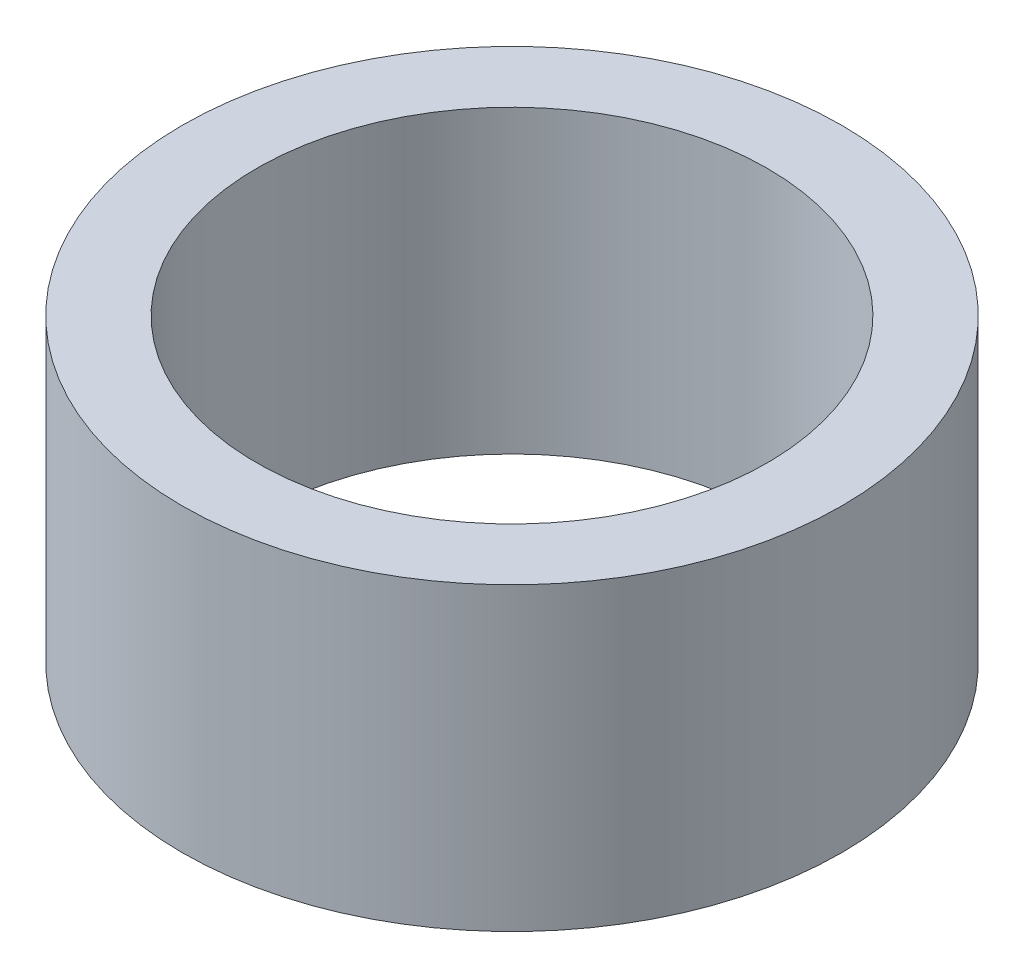
ISO-10303-21;
HEADER;
FILE_DESCRIPTION(('STEP AP214'),'2;1');
FILE_NAME('part.step','',(''),(''),'','','');
FILE_SCHEMA(('AUTOMOTIVE_DESIGN { 1 0 10303 214 1 1 1 1 }'));
ENDSEC;
DATA;
#1=APPLICATION_CONTEXT('core data for automotive mechanical design processes');
#2=APPLICATION_PROTOCOL_DEFINITION('international standard','automotive_design',2000,#1);
#3=PRODUCT_CONTEXT('',#1,'mechanical');
#4=PRODUCT('Part','Part','',(#3));
#5=PRODUCT_RELATED_PRODUCT_CATEGORY('part','',(#4));
#6=PRODUCT_DEFINITION_FORMATION('','',#4);
#7=PRODUCT_DEFINITION_CONTEXT('part definition',#1,'design');
#8=PRODUCT_DEFINITION('design','',#6,#7);
#9=PRODUCT_DEFINITION_SHAPE('','',#8);
#10=(LENGTH_UNIT() NAMED_UNIT(*) SI_UNIT(.MILLI.,.METRE.));
#11=(NAMED_UNIT(*) PLANE_ANGLE_UNIT() SI_UNIT($,.RADIAN.));
#12=(NAMED_UNIT(*) SI_UNIT($,.STERADIAN.) SOLID_ANGLE_UNIT());
#13=UNCERTAINTY_MEASURE_WITH_UNIT(LENGTH_MEASURE(1.E-05),#10,'distance_accuracy_value','');
#14=(GEOMETRIC_REPRESENTATION_CONTEXT(3) GLOBAL_UNCERTAINTY_ASSIGNED_CONTEXT((#13)) GLOBAL_UNIT_ASSIGNED_CONTEXT((#10,
#11,#12)) REPRESENTATION_CONTEXT('',''));
#15=CARTESIAN_POINT('',(0.,0.,0.));
#16=DIRECTION('',(0.,0.,1.));
#17=DIRECTION('',(1.,0.,0.));
#18=AXIS2_PLACEMENT_3D('',#15,#16,#17);
#19=CARTESIAN_POINT('',(0.,13.6638949893559,0.));
#20=DIRECTION('',(0.,-1.,0.));
#21=DIRECTION('',(0.,0.,-1.));
#22=AXIS2_PLACEMENT_3D('',#19,#20,#21);
#23=CYLINDRICAL_SURFACE('',#22,15.);
#24=CARTESIAN_POINT('',(0.,13.6638949893559,0.));
#25=DIRECTION('',(0.,1.,0.));
#26=DIRECTION('',(0.,0.,1.));
#27=AXIS2_PLACEMENT_3D('',#24,#25,#26);
#28=CIRCLE('',#27,15.);
#29=CARTESIAN_POINT('',(0.,13.6638949893559,-15.));
#30=VERTEX_POINT('',#29);
#31=EDGE_CURVE('E10',#30,#30,#28,.T.);
#32=CARTESIAN_POINT('',(0.,0.,0.));
#33=DIRECTION('',(0.,1.,0.));
#34=DIRECTION('',(0.,0.,1.));
#35=AXIS2_PLACEMENT_3D('',#32,#33,#34);
#36=CIRCLE('',#35,15.);
#37=CARTESIAN_POINT('',(0.,0.,-15.));
#38=VERTEX_POINT('',#37);
#39=EDGE_CURVE('E37',#38,#38,#36,.T.);
#40=CARTESIAN_POINT('',(0.,13.6638949893559,-15.));
#41=CARTESIAN_POINT('',(0.,13.5215627498835,-15.));
#42=CARTESIAN_POINT('',(0.,13.379230510411,-15.));
#43=CARTESIAN_POINT('',(0.,13.0945660314661,-15.));
#44=CARTESIAN_POINT('',(0.,12.9522337919936,-15.));
#45=CARTESIAN_POINT('',(0.,12.6675693130487,-15.));
#46=CARTESIAN_POINT('',(0.,12.5252370735763,-15.));
#47=CARTESIAN_POINT('',(0.,12.2405725946314,-15.));
#48=CARTESIAN_POINT('',(0.,12.0982403551589,-15.));
#49=CARTESIAN_POINT('',(0.,11.813575876214,-15.));
#50=CARTESIAN_POINT('',(0.,11.6712436367415,-15.));
#51=CARTESIAN_POINT('',(0.,11.3865791577966,-15.));
#52=CARTESIAN_POINT('',(0.,11.2442469183242,-15.));
#53=CARTESIAN_POINT('',(0.,10.9595824393792,-15.));
#54=CARTESIAN_POINT('',(0.,10.8172501999068,-15.));
#55=CARTESIAN_POINT('',(0.,10.5325857209619,-15.));
#56=CARTESIAN_POINT('',(0.,10.3902534814894,-15.));
#57=CARTESIAN_POINT('',(0.,10.1055890025445,-15.));
#58=CARTESIAN_POINT('',(0.,9.96325676307203,-15.));
#59=CARTESIAN_POINT('',(0.,9.67859228412712,-15.));
#60=CARTESIAN_POINT('',(0.,9.53626004465466,-15.));
#61=CARTESIAN_POINT('',(0.,9.25159556570974,-15.));
#62=CARTESIAN_POINT('',(0.,9.10926332623729,-15.));
#63=CARTESIAN_POINT('',(0.,8.82459884729237,-15.));
#64=CARTESIAN_POINT('',(0.,8.68226660781992,-15.));
#65=CARTESIAN_POINT('',(0.,8.397602128875,-15.));
#66=CARTESIAN_POINT('',(0.,8.25526988940254,-15.));
#67=CARTESIAN_POINT('',(0.,7.97060541045763,-15.));
#68=CARTESIAN_POINT('',(0.,7.82827317098517,-15.));
#69=CARTESIAN_POINT('',(0.,7.54360869204025,-15.));
#70=CARTESIAN_POINT('',(0.,7.4012764525678,-15.));
#71=CARTESIAN_POINT('',(0.,7.11661197362288,-15.));
#72=CARTESIAN_POINT('',(0.,6.97427973415042,-15.));
#73=CARTESIAN_POINT('',(0.,6.68961525520551,-15.));
#74=CARTESIAN_POINT('',(0.,6.54728301573305,-15.));
#75=CARTESIAN_POINT('',(0.,6.26261853678813,-15.));
#76=CARTESIAN_POINT('',(0.,6.12028629731568,-15.));
#77=CARTESIAN_POINT('',(0.,5.83562181837076,-15.));
#78=CARTESIAN_POINT('',(0.,5.69328957889831,-15.));
#79=CARTESIAN_POINT('',(0.,5.40862509995339,-15.));
#80=CARTESIAN_POINT('',(0.,5.26629286048093,-15.));
#81=CARTESIAN_POINT('',(0.,4.98162838153602,-15.));
#82=CARTESIAN_POINT('',(0.,4.83929614206356,-15.));
#83=CARTESIAN_POINT('',(0.,4.55463166311864,-15.));
#84=CARTESIAN_POINT('',(0.,4.41229942364619,-15.));
#85=CARTESIAN_POINT('',(0.,4.12763494470127,-15.));
#86=CARTESIAN_POINT('',(0.,3.98530270522881,-15.));
#87=CARTESIAN_POINT('',(0.,3.7006382262839,-15.));
#88=CARTESIAN_POINT('',(0.,3.55830598681144,-15.));
#89=CARTESIAN_POINT('',(0.,3.27364150786653,-15.));
#90=CARTESIAN_POINT('',(0.,3.13130926839407,-15.));
#91=CARTESIAN_POINT('',(0.,2.84664478944915,-15.));
#92=CARTESIAN_POINT('',(0.,2.70431254997669,-15.));
#93=CARTESIAN_POINT('',(0.,2.41964807103178,-15.));
#94=CARTESIAN_POINT('',(0.,2.27731583155932,-15.));
#95=CARTESIAN_POINT('',(0.,1.99265135261441,-15.));
#96=CARTESIAN_POINT('',(0.,1.85031911314195,-15.));
#97=CARTESIAN_POINT('',(0.,1.56565463419703,-15.));
#98=CARTESIAN_POINT('',(0.,1.42332239472458,-15.));
#99=CARTESIAN_POINT('',(0.,1.13865791577966,-15.));
#100=CARTESIAN_POINT('',(0.,0.996325676307204,-15.));
#101=CARTESIAN_POINT('',(0.,0.711661197362289,-15.));
#102=CARTESIAN_POINT('',(0.,0.569328957889831,-15.));
#103=CARTESIAN_POINT('',(0.,0.284664478944915,-15.));
#104=CARTESIAN_POINT('',(0.,0.142332239472458,-15.));
#105=CARTESIAN_POINT('',(0.,0.,-15.));
#106=B_SPLINE_CURVE_WITH_KNOTS('',3,(#40,#41,#42,#43,#44,#45,#46,#47,#48,#49,#50,#51,#52,#53,
#54,#55,#56,#57,#58,#59,#60,#61,#62,#63,#64,#65,#66,#67,#68,#69,#70,#71,#72,#73,#74,#75,#76,#77,
#78,#79,#80,#81,#82,#83,#84,#85,#86,#87,#88,#89,#90,#91,#92,#93,#94,#95,#96,#97,#98,#99,#100,
#101,#102,#103,#104,#105),.UNSPECIFIED.,.F.,.F.,(4,2,2,2,2,2,2,2,2,2,2,2,2,2,2,2,2,2,2,2,2,2,2,
2,2,2,2,2,2,2,2,2,4),(0.,0.426996718417371,0.853993436834744,1.28099015525212,1.70798687366949,
2.13498359208686,2.56198031050424,2.98897702892161,3.41597374733898,3.84297046575635,
4.26996718417373,4.6969639025911,5.12396062100847,5.55095733942585,5.97795405784322,
6.40495077626059,6.83194749467796,7.25894421309534,7.68594093151271,8.11293764993008,
8.53993436834746,8.96693108676483,9.3939278051822,9.82092452359957,10.2479212420169,
10.6749179604343,11.1019146788517,11.5289113972691,11.9559081156864,12.3829048341038,
12.8099015525212,13.2368982709386,13.6638949893559),.UNSPECIFIED.);
#107=EDGE_CURVE('BSEAM40',#30,#38,#106,.T.);
#108=ORIENTED_EDGE('',*,*,#31,.F.);
#109=ORIENTED_EDGE('',*,*,#39,.T.);
#110=ORIENTED_EDGE('',*,*,#107,.T.);
#111=ORIENTED_EDGE('',*,*,#107,.F.);
#112=EDGE_LOOP('',(#108,#110,#109,#111));
#113=FACE_BOUND('',#112,.T.);
#114=ADVANCED_FACE('F40',(#113),#23,.T.);
#115=CARTESIAN_POINT('',(0.,13.6638949893559,0.));
#116=DIRECTION('',(0.,1.,0.));
#117=DIRECTION('',(0.,0.,1.));
#118=AXIS2_PLACEMENT_3D('',#115,#116,#117);
#119=PLANE('',#118);
#120=CARTESIAN_POINT('',(0.,13.6638949893559,0.));
#121=DIRECTION('',(0.,1.,0.));
#122=DIRECTION('',(0.,0.,1.));
#123=AXIS2_PLACEMENT_3D('',#120,#121,#122);
#124=CIRCLE('',#123,11.611398963864);
#125=CARTESIAN_POINT('',(0.,13.6638949893559,-11.611398963864));
#126=VERTEX_POINT('',#125);
#127=EDGE_CURVE('E50',#126,#126,#124,.T.);
#128=ORIENTED_EDGE('',*,*,#127,.F.);
#129=EDGE_LOOP('',(#128));
#130=FACE_BOUND('',#129,.T.);
#131=ORIENTED_EDGE('',*,*,#31,.T.);
#132=EDGE_LOOP('',(#131));
#133=FACE_BOUND('',#132,.T.);
#134=ADVANCED_FACE('F59',(#130,#133),#119,.T.);
#135=CARTESIAN_POINT('',(0.,0.,0.));
#136=DIRECTION('',(0.,1.,0.));
#137=DIRECTION('',(0.,0.,1.));
#138=AXIS2_PLACEMENT_3D('',#135,#136,#137);
#139=PLANE('',#138);
#140=CARTESIAN_POINT('',(0.,0.,0.));
#141=DIRECTION('',(0.,1.,0.));
#142=DIRECTION('',(0.,0.,1.));
#143=AXIS2_PLACEMENT_3D('',#140,#141,#142);
#144=CIRCLE('',#143,11.611398963864);
#145=CARTESIAN_POINT('',(0.,0.,-11.611398963864));
#146=VERTEX_POINT('',#145);
#147=EDGE_CURVE('E47',#146,#146,#144,.T.);
#148=ORIENTED_EDGE('',*,*,#147,.T.);
#149=EDGE_LOOP('',(#148));
#150=FACE_BOUND('',#149,.T.);
#151=ORIENTED_EDGE('',*,*,#39,.F.);
#152=EDGE_LOOP('',(#151));
#153=FACE_BOUND('',#152,.T.);
#154=ADVANCED_FACE('F58',(#150,#153),#139,.F.);
#155=CARTESIAN_POINT('',(0.,13.6638949893559,0.));
#156=DIRECTION('',(0.,-1.,0.));
#157=DIRECTION('',(0.,0.,-1.));
#158=AXIS2_PLACEMENT_3D('',#155,#156,#157);
#159=CYLINDRICAL_SURFACE('',#158,11.611398963864);
#160=CARTESIAN_POINT('',(0.,13.6638949893559,-11.611398963864));
#161=CARTESIAN_POINT('',(0.,13.5215627498835,-11.611398963864));
#162=CARTESIAN_POINT('',(0.,13.379230510411,-11.611398963864));
#163=CARTESIAN_POINT('',(0.,13.0945660314661,-11.611398963864));
#164=CARTESIAN_POINT('',(0.,12.9522337919936,-11.611398963864));
#165=CARTESIAN_POINT('',(0.,12.6675693130487,-11.611398963864));
#166=CARTESIAN_POINT('',(0.,12.5252370735763,-11.611398963864));
#167=CARTESIAN_POINT('',(0.,12.2405725946314,-11.611398963864));
#168=CARTESIAN_POINT('',(0.,12.0982403551589,-11.611398963864));
#169=CARTESIAN_POINT('',(0.,11.813575876214,-11.611398963864));
#170=CARTESIAN_POINT('',(0.,11.6712436367415,-11.611398963864));
#171=CARTESIAN_POINT('',(0.,11.3865791577966,-11.611398963864));
#172=CARTESIAN_POINT('',(0.,11.2442469183242,-11.611398963864));
#173=CARTESIAN_POINT('',(0.,10.9595824393792,-11.611398963864));
#174=CARTESIAN_POINT('',(0.,10.8172501999068,-11.611398963864));
#175=CARTESIAN_POINT('',(0.,10.5325857209619,-11.611398963864));
#176=CARTESIAN_POINT('',(0.,10.3902534814894,-11.611398963864));
#177=CARTESIAN_POINT('',(0.,10.1055890025445,-11.611398963864));
#178=CARTESIAN_POINT('',(0.,9.96325676307203,-11.611398963864));
#179=CARTESIAN_POINT('',(0.,9.67859228412712,-11.611398963864));
#180=CARTESIAN_POINT('',(0.,9.53626004465466,-11.611398963864));
#181=CARTESIAN_POINT('',(0.,9.25159556570974,-11.611398963864));
#182=CARTESIAN_POINT('',(0.,9.10926332623729,-11.611398963864));
#183=CARTESIAN_POINT('',(0.,8.82459884729237,-11.611398963864));
#184=CARTESIAN_POINT('',(0.,8.68226660781991,-11.611398963864));
#185=CARTESIAN_POINT('',(0.,8.397602128875,-11.611398963864));
#186=CARTESIAN_POINT('',(0.,8.25526988940254,-11.611398963864));
#187=CARTESIAN_POINT('',(0.,7.97060541045763,-11.611398963864));
#188=CARTESIAN_POINT('',(0.,7.82827317098517,-11.611398963864));
#189=CARTESIAN_POINT('',(0.,7.54360869204025,-11.611398963864));
#190=CARTESIAN_POINT('',(0.,7.4012764525678,-11.611398963864));
#191=CARTESIAN_POINT('',(0.,7.11661197362288,-11.611398963864));
#192=CARTESIAN_POINT('',(0.,6.97427973415042,-11.611398963864));
#193=CARTESIAN_POINT('',(0.,6.68961525520551,-11.611398963864));
#194=CARTESIAN_POINT('',(0.,6.54728301573305,-11.611398963864));
#195=CARTESIAN_POINT('',(0.,6.26261853678813,-11.611398963864));
#196=CARTESIAN_POINT('',(0.,6.12028629731568,-11.611398963864));
#197=CARTESIAN_POINT('',(0.,5.83562181837076,-11.611398963864));
#198=CARTESIAN_POINT('',(0.,5.6932895788983,-11.611398963864));
#199=CARTESIAN_POINT('',(0.,5.40862509995339,-11.611398963864));
#200=CARTESIAN_POINT('',(0.,5.26629286048093,-11.611398963864));
#201=CARTESIAN_POINT('',(0.,4.98162838153602,-11.611398963864));
#202=CARTESIAN_POINT('',(0.,4.83929614206356,-11.611398963864));
#203=CARTESIAN_POINT('',(0.,4.55463166311864,-11.611398963864));
#204=CARTESIAN_POINT('',(0.,4.41229942364619,-11.611398963864));
#205=CARTESIAN_POINT('',(0.,4.12763494470127,-11.611398963864));
#206=CARTESIAN_POINT('',(0.,3.98530270522881,-11.611398963864));
#207=CARTESIAN_POINT('',(0.,3.7006382262839,-11.611398963864));
#208=CARTESIAN_POINT('',(0.,3.55830598681144,-11.611398963864));
#209=CARTESIAN_POINT('',(0.,3.27364150786653,-11.611398963864));
#210=CARTESIAN_POINT('',(0.,3.13130926839407,-11.611398963864));
#211=CARTESIAN_POINT('',(0.,2.84664478944915,-11.611398963864));
#212=CARTESIAN_POINT('',(0.,2.70431254997669,-11.611398963864));
#213=CARTESIAN_POINT('',(0.,2.41964807103178,-11.611398963864));
#214=CARTESIAN_POINT('',(0.,2.27731583155932,-11.611398963864));
#215=CARTESIAN_POINT('',(0.,1.99265135261441,-11.611398963864));
#216=CARTESIAN_POINT('',(0.,1.85031911314195,-11.611398963864));
#217=CARTESIAN_POINT('',(0.,1.56565463419703,-11.611398963864));
#218=CARTESIAN_POINT('',(0.,1.42332239472458,-11.611398963864));
#219=CARTESIAN_POINT('',(0.,1.13865791577966,-11.611398963864));
#220=CARTESIAN_POINT('',(0.,0.996325676307204,-11.611398963864));
#221=CARTESIAN_POINT('',(0.,0.711661197362289,-11.611398963864));
#222=CARTESIAN_POINT('',(0.,0.569328957889831,-11.611398963864));
#223=CARTESIAN_POINT('',(0.,0.284664478944915,-11.611398963864));
#224=CARTESIAN_POINT('',(0.,0.142332239472458,-11.611398963864));
#225=CARTESIAN_POINT('',(0.,0.,-11.611398963864));
#226=B_SPLINE_CURVE_WITH_KNOTS('',3,(#160,#161,#162,#163,#164,#165,#166,#167,#168,#169,#170,
#171,#172,#173,#174,#175,#176,#177,#178,#179,#180,#181,#182,#183,#184,#185,#186,#187,#188,#189,
#190,#191,#192,#193,#194,#195,#196,#197,#198,#199,#200,#201,#202,#203,#204,#205,#206,#207,#208,
#209,#210,#211,#212,#213,#214,#215,#216,#217,#218,#219,#220,#221,#222,#223,#224,#225),
.UNSPECIFIED.,.F.,.F.,(4,2,2,2,2,2,2,2,2,2,2,2,2,2,2,2,2,2,2,2,2,2,2,2,2,2,2,2,2,2,2,2,4),(0.,
0.426996718417373,0.853993436834746,1.28099015525212,1.70798687366949,2.13498359208687,
2.56198031050424,2.98897702892161,3.41597374733898,3.84297046575636,4.26996718417373,
4.6969639025911,5.12396062100848,5.55095733942585,5.97795405784322,6.40495077626059,
6.83194749467797,7.25894421309534,7.68594093151271,8.11293764993008,8.53993436834746,
8.96693108676483,9.3939278051822,9.82092452359958,10.2479212420169,10.6749179604343,
11.1019146788517,11.5289113972691,11.9559081156864,12.3829048341038,12.8099015525212,
13.2368982709386,13.6638949893559),.UNSPECIFIED.);
#227=EDGE_CURVE('BSEAM54',#126,#146,#226,.T.);
#228=ORIENTED_EDGE('',*,*,#127,.T.);
#229=ORIENTED_EDGE('',*,*,#147,.F.);
#230=ORIENTED_EDGE('',*,*,#227,.T.);
#231=ORIENTED_EDGE('',*,*,#227,.F.);
#232=EDGE_LOOP('',(#228,#230,#229,#231));
#233=FACE_BOUND('',#232,.T.);
#234=ADVANCED_FACE('F54',(#233),#159,.F.);
#235=CLOSED_SHELL('',(#114,#134,#154,#234));
#236=MANIFOLD_SOLID_BREP('B2',#235);
#237=ADVANCED_BREP_SHAPE_REPRESENTATION('',(#18,#236),#14);
#238=SHAPE_DEFINITION_REPRESENTATION(#9,#237);
ENDSEC;
END-ISO-10303-21;
